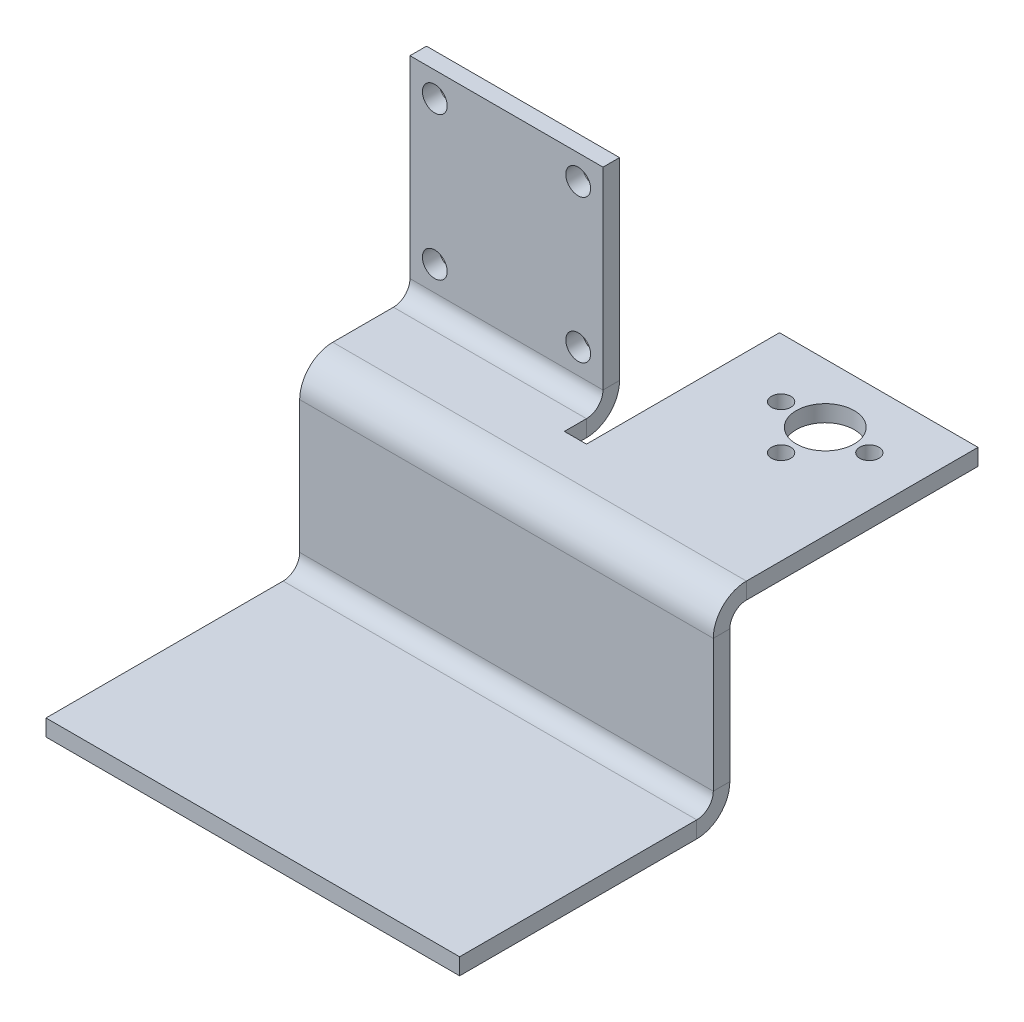
ISO-10303-21;
HEADER;
FILE_DESCRIPTION(('STEP AP214'),'2;1');
FILE_NAME('part.step','',(''),(''),'','','');
FILE_SCHEMA(('AUTOMOTIVE_DESIGN { 1 0 10303 214 1 1 1 1 }'));
ENDSEC;
DATA;
#1=APPLICATION_CONTEXT('core data for automotive mechanical design processes');
#2=APPLICATION_PROTOCOL_DEFINITION('international standard','automotive_design',2000,#1);
#3=PRODUCT_CONTEXT('',#1,'mechanical');
#4=PRODUCT('Part','Part','',(#3));
#5=PRODUCT_RELATED_PRODUCT_CATEGORY('part','',(#4));
#6=PRODUCT_DEFINITION_FORMATION('','',#4);
#7=PRODUCT_DEFINITION_CONTEXT('part definition',#1,'design');
#8=PRODUCT_DEFINITION('design','',#6,#7);
#9=PRODUCT_DEFINITION_SHAPE('','',#8);
#10=(LENGTH_UNIT() NAMED_UNIT(*) SI_UNIT(.MILLI.,.METRE.));
#11=(NAMED_UNIT(*) PLANE_ANGLE_UNIT() SI_UNIT($,.RADIAN.));
#12=(NAMED_UNIT(*) SI_UNIT($,.STERADIAN.) SOLID_ANGLE_UNIT());
#13=UNCERTAINTY_MEASURE_WITH_UNIT(LENGTH_MEASURE(1.E-05),#10,'distance_accuracy_value','');
#14=(GEOMETRIC_REPRESENTATION_CONTEXT(3) GLOBAL_UNCERTAINTY_ASSIGNED_CONTEXT((#13)) GLOBAL_UNIT_ASSIGNED_CONTEXT((#10,
#11,#12)) REPRESENTATION_CONTEXT('',''));
#15=CARTESIAN_POINT('',(0.,0.,0.));
#16=DIRECTION('',(0.,0.,1.));
#17=DIRECTION('',(1.,0.,0.));
#18=AXIS2_PLACEMENT_3D('',#15,#16,#17);
#19=CARTESIAN_POINT('',(57.5,-23.5,20.));
#20=DIRECTION('',(-1.,0.,0.));
#21=DIRECTION('',(0.,0.,1.));
#22=AXIS2_PLACEMENT_3D('',#19,#20,#21);
#23=PLANE('',#22);
#24=DIRECTION('',(0.,0.,-1.));
#25=VECTOR('',#24,1.);
#26=CARTESIAN_POINT('',(57.5,-50.5000000000001,20.));
#27=LINE('',#26,#25);
#28=CARTESIAN_POINT('',(57.5,-50.5000000000001,20.));
#29=VERTEX_POINT('',#28);
#30=CARTESIAN_POINT('',(57.5,-50.5000000000001,17.));
#31=VERTEX_POINT('',#30);
#32=EDGE_CURVE('E318',#29,#31,#27,.T.);
#33=ORIENTED_EDGE('',*,*,#32,.T.);
#34=DIRECTION('',(0.,1.,0.));
#35=VECTOR('',#34,1.);
#36=CARTESIAN_POINT('',(57.5,-23.5,17.));
#37=LINE('',#36,#35);
#38=CARTESIAN_POINT('',(57.5,-26.5,17.));
#39=VERTEX_POINT('',#38);
#40=EDGE_CURVE('E344',#31,#39,#37,.T.);
#41=ORIENTED_EDGE('',*,*,#40,.T.);
#42=DIRECTION('',(0.,0.,1.));
#43=VECTOR('',#42,1.);
#44=CARTESIAN_POINT('',(57.5,-26.5,17.));
#45=LINE('',#44,#43);
#46=CARTESIAN_POINT('',(57.5,-26.5,20.));
#47=VERTEX_POINT('',#46);
#48=EDGE_CURVE('E330',#39,#47,#45,.T.);
#49=ORIENTED_EDGE('',*,*,#48,.T.);
#50=DIRECTION('',(0.,1.,0.));
#51=VECTOR('',#50,1.);
#52=CARTESIAN_POINT('',(57.5,-23.5,20.));
#53=LINE('',#52,#51);
#54=EDGE_CURVE('E345',#29,#47,#53,.T.);
#55=ORIENTED_EDGE('',*,*,#54,.F.);
#56=EDGE_LOOP('',(#33,#41,#49,#55));
#57=FACE_BOUND('',#56,.T.);
#58=ADVANCED_FACE('F69',(#57),#23,.F.);
#59=CARTESIAN_POINT('',(-17.5,-53.5,20.));
#60=DIRECTION('',(1.,0.,0.));
#61=DIRECTION('',(0.,1.,0.));
#62=AXIS2_PLACEMENT_3D('',#59,#60,#61);
#63=PLANE('',#62);
#64=DIRECTION('',(0.,0.,-1.));
#65=VECTOR('',#64,1.);
#66=CARTESIAN_POINT('',(-17.5,-50.5000000000001,20.));
#67=LINE('',#66,#65);
#68=CARTESIAN_POINT('',(-17.5,-50.5000000000001,20.));
#69=VERTEX_POINT('',#68);
#70=CARTESIAN_POINT('',(-17.5,-50.5,17.));
#71=VERTEX_POINT('',#70);
#72=EDGE_CURVE('E328',#69,#71,#67,.T.);
#73=ORIENTED_EDGE('',*,*,#72,.F.);
#74=DIRECTION('',(0.,-1.,0.));
#75=VECTOR('',#74,1.);
#76=CARTESIAN_POINT('',(-17.5,-53.5,20.));
#77=LINE('',#76,#75);
#78=CARTESIAN_POINT('',(-17.5,-26.5,20.));
#79=VERTEX_POINT('',#78);
#80=EDGE_CURVE('E348',#79,#69,#77,.T.);
#81=ORIENTED_EDGE('',*,*,#80,.F.);
#82=DIRECTION('',(0.,0.,1.));
#83=VECTOR('',#82,1.);
#84=CARTESIAN_POINT('',(-17.5,-26.5,17.));
#85=LINE('',#84,#83);
#86=CARTESIAN_POINT('',(-17.5,-26.5,17.));
#87=VERTEX_POINT('',#86);
#88=EDGE_CURVE('E335',#87,#79,#85,.T.);
#89=ORIENTED_EDGE('',*,*,#88,.F.);
#90=DIRECTION('',(0.,-1.,0.));
#91=VECTOR('',#90,1.);
#92=CARTESIAN_POINT('',(-17.5,-53.5,17.));
#93=LINE('',#92,#91);
#94=EDGE_CURVE('E349',#87,#71,#93,.T.);
#95=ORIENTED_EDGE('',*,*,#94,.T.);
#96=EDGE_LOOP('',(#73,#81,#89,#95));
#97=FACE_BOUND('',#96,.T.);
#98=ADVANCED_FACE('F587',(#97),#63,.F.);
#99=CARTESIAN_POINT('',(0.,0.,20.));
#100=DIRECTION('',(0.,0.,-1.));
#101=DIRECTION('',(-1.,0.,0.));
#102=AXIS2_PLACEMENT_3D('',#99,#100,#101);
#103=PLANE('',#102);
#104=DIRECTION('',(1.,0.,0.));
#105=VECTOR('',#104,1.);
#106=CARTESIAN_POINT('',(57.5,-50.5000000000001,20.));
#107=LINE('',#106,#105);
#108=EDGE_CURVE('E323',#29,#69,#107,.F.);
#109=ORIENTED_EDGE('',*,*,#108,.F.);
#110=ORIENTED_EDGE('',*,*,#54,.T.);
#111=DIRECTION('',(1.,0.,0.));
#112=VECTOR('',#111,1.);
#113=CARTESIAN_POINT('',(0.,-26.5,20.));
#114=LINE('',#113,#112);
#115=EDGE_CURVE('E338',#79,#47,#114,.T.);
#116=ORIENTED_EDGE('',*,*,#115,.F.);
#117=ORIENTED_EDGE('',*,*,#80,.T.);
#118=EDGE_LOOP('',(#109,#110,#116,#117));
#119=FACE_BOUND('',#118,.T.);
#120=ADVANCED_FACE('F592',(#119),#103,.F.);
#121=CARTESIAN_POINT('',(0.,0.,17.));
#122=DIRECTION('',(0.,0.,-1.));
#123=DIRECTION('',(-1.,0.,0.));
#124=AXIS2_PLACEMENT_3D('',#121,#122,#123);
#125=PLANE('',#124);
#126=ORIENTED_EDGE('',*,*,#40,.F.);
#127=DIRECTION('',(1.,0.,0.));
#128=VECTOR('',#127,1.);
#129=CARTESIAN_POINT('',(57.5,-50.5000000000001,17.));
#130=LINE('',#129,#128);
#131=EDGE_CURVE('E261',#31,#71,#130,.F.);
#132=ORIENTED_EDGE('',*,*,#131,.T.);
#133=ORIENTED_EDGE('',*,*,#94,.F.);
#134=DIRECTION('',(-1.,0.,0.));
#135=VECTOR('',#134,1.);
#136=CARTESIAN_POINT('',(57.5,-26.5,17.));
#137=LINE('',#136,#135);
#138=EDGE_CURVE('E332',#39,#87,#137,.T.);
#139=ORIENTED_EDGE('',*,*,#138,.F.);
#140=EDGE_LOOP('',(#126,#132,#133,#139));
#141=FACE_BOUND('',#140,.T.);
#142=ADVANCED_FACE('F584',(#141),#125,.T.);
#143=CARTESIAN_POINT('',(-17.5,-23.5,0.));
#144=DIRECTION('',(1.,0.,0.));
#145=DIRECTION('',(0.,0.,-1.));
#146=AXIS2_PLACEMENT_3D('',#143,#144,#145);
#147=PLANE('',#146);
#148=DIRECTION('',(0.,1.,0.));
#149=VECTOR('',#148,1.);
#150=CARTESIAN_POINT('',(-17.5,-23.5,14.));
#151=LINE('',#150,#149);
#152=CARTESIAN_POINT('',(-17.5,-23.5,14.));
#153=VERTEX_POINT('',#152);
#154=CARTESIAN_POINT('',(-17.5,-20.5,14.));
#155=VERTEX_POINT('',#154);
#156=EDGE_CURVE('E368',#153,#155,#151,.T.);
#157=ORIENTED_EDGE('',*,*,#156,.T.);
#158=DIRECTION('',(0.,0.,1.));
#159=VECTOR('',#158,1.);
#160=CARTESIAN_POINT('',(-17.5,-20.5,0.));
#161=LINE('',#160,#159);
#162=CARTESIAN_POINT('',(-17.5,-20.5,2.99999999999999));
#163=VERTEX_POINT('',#162);
#164=EDGE_CURVE('E439',#155,#163,#161,.F.);
#165=ORIENTED_EDGE('',*,*,#164,.T.);
#166=DIRECTION('',(0.,1.,0.));
#167=VECTOR('',#166,1.);
#168=CARTESIAN_POINT('',(-17.5,-23.5,2.99999999999998));
#169=LINE('',#168,#167);
#170=CARTESIAN_POINT('',(-17.5,-23.5,2.99999999999998));
#171=VERTEX_POINT('',#170);
#172=EDGE_CURVE('E420',#163,#171,#169,.F.);
#173=ORIENTED_EDGE('',*,*,#172,.T.);
#174=DIRECTION('',(0.,0.,-1.));
#175=VECTOR('',#174,1.);
#176=CARTESIAN_POINT('',(-17.5,-23.5,0.));
#177=LINE('',#176,#175);
#178=EDGE_CURVE('E432',#153,#171,#177,.T.);
#179=ORIENTED_EDGE('',*,*,#178,.F.);
#180=EDGE_LOOP('',(#157,#165,#173,#179));
#181=FACE_BOUND('',#180,.T.);
#182=ADVANCED_FACE('F562',(#181),#147,.F.);
#183=CARTESIAN_POINT('',(0.,-23.5,0.));
#184=DIRECTION('',(0.,1.,0.));
#185=DIRECTION('',(0.,0.,1.));
#186=AXIS2_PLACEMENT_3D('',#183,#184,#185);
#187=PLANE('',#186);
#188=CARTESIAN_POINT('',(32.5,-23.4999999999999,-17.3));
#189=DIRECTION('',(0.,1.,0.));
#190=DIRECTION('',(0.,0.,1.));
#191=AXIS2_PLACEMENT_3D('',#188,#189,#190);
#192=CIRCLE('',#191,1.75);
#193=CARTESIAN_POINT('',(32.5,-23.4999999999999,-15.55));
#194=VERTEX_POINT('',#193);
#195=EDGE_CURVE('E1033',#194,#194,#192,.T.);
#196=ORIENTED_EDGE('',*,*,#195,.T.);
#197=EDGE_LOOP('',(#196));
#198=FACE_BOUND('',#197,.T.);
#199=CARTESIAN_POINT('',(48.5,-23.4999999999999,-17.3));
#200=DIRECTION('',(0.,1.,0.));
#201=DIRECTION('',(0.,0.,1.));
#202=AXIS2_PLACEMENT_3D('',#199,#200,#201);
#203=CIRCLE('',#202,1.75);
#204=CARTESIAN_POINT('',(48.5,-23.4999999999999,-15.55));
#205=VERTEX_POINT('',#204);
#206=EDGE_CURVE('E1036',#205,#205,#203,.T.);
#207=ORIENTED_EDGE('',*,*,#206,.T.);
#208=EDGE_LOOP('',(#207));
#209=FACE_BOUND('',#208,.T.);
#210=CARTESIAN_POINT('',(40.5,-23.5,-9.29999999999999));
#211=DIRECTION('',(0.,1.,0.));
#212=DIRECTION('',(0.,0.,1.));
#213=AXIS2_PLACEMENT_3D('',#210,#211,#212);
#214=CIRCLE('',#213,1.75);
#215=CARTESIAN_POINT('',(40.5,-23.5,-7.54999999999999));
#216=VERTEX_POINT('',#215);
#217=EDGE_CURVE('E1043',#216,#216,#214,.T.);
#218=ORIENTED_EDGE('',*,*,#217,.T.);
#219=EDGE_LOOP('',(#218));
#220=FACE_BOUND('',#219,.T.);
#221=CARTESIAN_POINT('',(40.5,-23.4999999999999,-17.3));
#222=DIRECTION('',(0.,1.,0.));
#223=DIRECTION('',(0.,0.,1.));
#224=AXIS2_PLACEMENT_3D('',#221,#222,#223);
#225=CIRCLE('',#224,5.25);
#226=CARTESIAN_POINT('',(40.5,-23.4999999999999,-12.05));
#227=VERTEX_POINT('',#226);
#228=EDGE_CURVE('E1057',#227,#227,#225,.T.);
#229=ORIENTED_EDGE('',*,*,#228,.T.);
#230=EDGE_LOOP('',(#229));
#231=FACE_BOUND('',#230,.T.);
#232=DIRECTION('',(-1.,0.,0.));
#233=VECTOR('',#232,1.);
#234=CARTESIAN_POINT('',(-17.5,-23.5,14.));
#235=LINE('',#234,#233);
#236=CARTESIAN_POINT('',(57.5,-23.5,14.));
#237=VERTEX_POINT('',#236);
#238=EDGE_CURVE('E376',#153,#237,#235,.F.);
#239=ORIENTED_EDGE('',*,*,#238,.F.);
#240=ORIENTED_EDGE('',*,*,#178,.T.);
#241=DIRECTION('',(1.,0.,0.));
#242=VECTOR('',#241,1.);
#243=CARTESIAN_POINT('',(-17.5,-23.5,2.99999999999998));
#244=LINE('',#243,#242);
#245=CARTESIAN_POINT('',(17.5,-23.5,2.99999999999998));
#246=VERTEX_POINT('',#245);
#247=EDGE_CURVE('E442',#246,#171,#244,.F.);
#248=ORIENTED_EDGE('',*,*,#247,.F.);
#249=DIRECTION('',(0.,0.,1.));
#250=VECTOR('',#249,1.);
#251=CARTESIAN_POINT('',(17.5,-23.5,0.));
#252=LINE('',#251,#250);
#253=CARTESIAN_POINT('',(17.5,-23.5,6.99999999999998));
#254=VERTEX_POINT('',#253);
#255=EDGE_CURVE('E427',#246,#254,#252,.T.);
#256=ORIENTED_EDGE('',*,*,#255,.T.);
#257=DIRECTION('',(1.,0.,0.));
#258=VECTOR('',#257,1.);
#259=CARTESIAN_POINT('',(0.,-23.5,6.99999999999998));
#260=LINE('',#259,#258);
#261=CARTESIAN_POINT('',(21.5,-23.5,6.99999999999998));
#262=VERTEX_POINT('',#261);
#263=EDGE_CURVE('E406',#254,#262,#260,.T.);
#264=ORIENTED_EDGE('',*,*,#263,.T.);
#265=DIRECTION('',(0.,0.,-1.));
#266=VECTOR('',#265,1.);
#267=CARTESIAN_POINT('',(21.5,-23.5,0.));
#268=LINE('',#267,#266);
#269=CARTESIAN_POINT('',(21.5,-23.4999999999999,-28.));
#270=VERTEX_POINT('',#269);
#271=EDGE_CURVE('E410',#262,#270,#268,.T.);
#272=ORIENTED_EDGE('',*,*,#271,.T.);
#273=DIRECTION('',(-1.,0.,0.));
#274=VECTOR('',#273,1.);
#275=CARTESIAN_POINT('',(0.,-23.4999999999999,-28.));
#276=LINE('',#275,#274);
#277=CARTESIAN_POINT('',(57.5,-23.4999999999999,-28.));
#278=VERTEX_POINT('',#277);
#279=EDGE_CURVE('E392',#278,#270,#276,.T.);
#280=ORIENTED_EDGE('',*,*,#279,.F.);
#281=DIRECTION('',(0.,0.,-1.));
#282=VECTOR('',#281,1.);
#283=CARTESIAN_POINT('',(57.5,-23.5,0.));
#284=LINE('',#283,#282);
#285=EDGE_CURVE('E385',#237,#278,#284,.T.);
#286=ORIENTED_EDGE('',*,*,#285,.F.);
#287=EDGE_LOOP('',(#239,#240,#248,#256,#264,#272,#280,#286));
#288=FACE_BOUND('',#287,.T.);
#289=ADVANCED_FACE('F552',(#198,#209,#220,#231,#288),#187,.F.);
#290=CARTESIAN_POINT('',(0.,-20.5,0.));
#291=DIRECTION('',(0.,1.,0.));
#292=DIRECTION('',(0.,0.,1.));
#293=AXIS2_PLACEMENT_3D('',#290,#291,#292);
#294=PLANE('',#293);
#295=CARTESIAN_POINT('',(32.5,-20.4999999999999,-17.3));
#296=DIRECTION('',(0.,1.,0.));
#297=DIRECTION('',(0.,0.,1.));
#298=AXIS2_PLACEMENT_3D('',#295,#296,#297);
#299=CIRCLE('',#298,1.75);
#300=CARTESIAN_POINT('',(32.5,-20.4999999999999,-15.55));
#301=VERTEX_POINT('',#300);
#302=EDGE_CURVE('E1030',#301,#301,#299,.T.);
#303=ORIENTED_EDGE('',*,*,#302,.F.);
#304=EDGE_LOOP('',(#303));
#305=FACE_BOUND('',#304,.T.);
#306=CARTESIAN_POINT('',(48.5,-20.4999999999999,-17.3));
#307=DIRECTION('',(0.,1.,0.));
#308=DIRECTION('',(0.,0.,1.));
#309=AXIS2_PLACEMENT_3D('',#306,#307,#308);
#310=CIRCLE('',#309,1.75);
#311=CARTESIAN_POINT('',(48.5,-20.4999999999999,-15.55));
#312=VERTEX_POINT('',#311);
#313=EDGE_CURVE('E1063',#312,#312,#310,.T.);
#314=ORIENTED_EDGE('',*,*,#313,.F.);
#315=EDGE_LOOP('',(#314));
#316=FACE_BOUND('',#315,.T.);
#317=CARTESIAN_POINT('',(40.5,-20.5,-9.29999999999998));
#318=DIRECTION('',(0.,1.,0.));
#319=DIRECTION('',(0.,0.,1.));
#320=AXIS2_PLACEMENT_3D('',#317,#318,#319);
#321=CIRCLE('',#320,1.75);
#322=CARTESIAN_POINT('',(40.5,-20.5,-7.54999999999998));
#323=VERTEX_POINT('',#322);
#324=EDGE_CURVE('E1058',#323,#323,#321,.T.);
#325=ORIENTED_EDGE('',*,*,#324,.F.);
#326=EDGE_LOOP('',(#325));
#327=FACE_BOUND('',#326,.T.);
#328=CARTESIAN_POINT('',(40.5,-20.4999999999999,-17.3));
#329=DIRECTION('',(0.,1.,0.));
#330=DIRECTION('',(0.,0.,1.));
#331=AXIS2_PLACEMENT_3D('',#328,#329,#330);
#332=CIRCLE('',#331,5.25);
#333=CARTESIAN_POINT('',(40.5,-20.4999999999999,-12.05));
#334=VERTEX_POINT('',#333);
#335=EDGE_CURVE('E1054',#334,#334,#332,.T.);
#336=ORIENTED_EDGE('',*,*,#335,.F.);
#337=EDGE_LOOP('',(#336));
#338=FACE_BOUND('',#337,.T.);
#339=ORIENTED_EDGE('',*,*,#164,.F.);
#340=DIRECTION('',(-1.,0.,0.));
#341=VECTOR('',#340,1.);
#342=CARTESIAN_POINT('',(-17.5,-20.5,14.));
#343=LINE('',#342,#341);
#344=CARTESIAN_POINT('',(57.5,-20.5,14.));
#345=VERTEX_POINT('',#344);
#346=EDGE_CURVE('E359',#155,#345,#343,.F.);
#347=ORIENTED_EDGE('',*,*,#346,.T.);
#348=DIRECTION('',(0.,0.,-1.));
#349=VECTOR('',#348,1.);
#350=CARTESIAN_POINT('',(57.5,-20.5,0.));
#351=LINE('',#350,#349);
#352=CARTESIAN_POINT('',(57.5,-20.4999999999999,-28.));
#353=VERTEX_POINT('',#352);
#354=EDGE_CURVE('E388',#345,#353,#351,.T.);
#355=ORIENTED_EDGE('',*,*,#354,.T.);
#356=DIRECTION('',(-1.,0.,0.));
#357=VECTOR('',#356,1.);
#358=CARTESIAN_POINT('',(0.,-20.4999999999999,-28.));
#359=LINE('',#358,#357);
#360=CARTESIAN_POINT('',(21.5,-20.4999999999999,-28.));
#361=VERTEX_POINT('',#360);
#362=EDGE_CURVE('E400',#353,#361,#359,.T.);
#363=ORIENTED_EDGE('',*,*,#362,.T.);
#364=DIRECTION('',(0.,0.,-1.));
#365=VECTOR('',#364,1.);
#366=CARTESIAN_POINT('',(21.5,-20.5,0.));
#367=LINE('',#366,#365);
#368=CARTESIAN_POINT('',(21.5,-20.5,6.99999999999999));
#369=VERTEX_POINT('',#368);
#370=EDGE_CURVE('E396',#369,#361,#367,.T.);
#371=ORIENTED_EDGE('',*,*,#370,.F.);
#372=DIRECTION('',(1.,0.,0.));
#373=VECTOR('',#372,1.);
#374=CARTESIAN_POINT('',(0.,-20.5,6.99999999999999));
#375=LINE('',#374,#373);
#376=CARTESIAN_POINT('',(17.5,-20.5,6.99999999999999));
#377=VERTEX_POINT('',#376);
#378=EDGE_CURVE('E391',#377,#369,#375,.T.);
#379=ORIENTED_EDGE('',*,*,#378,.F.);
#380=DIRECTION('',(0.,0.,-1.));
#381=VECTOR('',#380,1.);
#382=CARTESIAN_POINT('',(17.5,-20.5,17.));
#383=LINE('',#382,#381);
#384=CARTESIAN_POINT('',(17.5,-20.5,2.99999999999999));
#385=VERTEX_POINT('',#384);
#386=EDGE_CURVE('E435',#385,#377,#383,.F.);
#387=ORIENTED_EDGE('',*,*,#386,.F.);
#388=DIRECTION('',(1.,0.,0.));
#389=VECTOR('',#388,1.);
#390=CARTESIAN_POINT('',(-17.5,-20.5,2.99999999999999));
#391=LINE('',#390,#389);
#392=EDGE_CURVE('E449',#163,#385,#391,.T.);
#393=ORIENTED_EDGE('',*,*,#392,.F.);
#394=EDGE_LOOP('',(#339,#347,#355,#363,#371,#379,#387,#393));
#395=FACE_BOUND('',#394,.T.);
#396=ADVANCED_FACE('F543',(#305,#316,#327,#338,#395),#294,.T.);
#397=CARTESIAN_POINT('',(57.5,-20.5,0.));
#398=DIRECTION('',(-1.,0.,0.));
#399=DIRECTION('',(0.,0.,1.));
#400=AXIS2_PLACEMENT_3D('',#397,#398,#399);
#401=PLANE('',#400);
#402=DIRECTION('',(0.,1.,0.));
#403=VECTOR('',#402,1.);
#404=CARTESIAN_POINT('',(57.5,-23.5,14.));
#405=LINE('',#404,#403);
#406=EDGE_CURVE('E382',#237,#345,#405,.T.);
#407=ORIENTED_EDGE('',*,*,#406,.F.);
#408=ORIENTED_EDGE('',*,*,#285,.T.);
#409=DIRECTION('',(0.,-1.,0.));
#410=VECTOR('',#409,1.);
#411=CARTESIAN_POINT('',(57.5,-20.4999999999999,-28.));
#412=LINE('',#411,#410);
#413=EDGE_CURVE('E417',#353,#278,#412,.T.);
#414=ORIENTED_EDGE('',*,*,#413,.F.);
#415=ORIENTED_EDGE('',*,*,#354,.F.);
#416=EDGE_LOOP('',(#407,#408,#414,#415));
#417=FACE_BOUND('',#416,.T.);
#418=ADVANCED_FACE('F576',(#417),#401,.F.);
#419=CARTESIAN_POINT('',(17.5,-17.5,-3.));
#420=DIRECTION('',(1.,0.,0.));
#421=DIRECTION('',(0.,1.,0.));
#422=AXIS2_PLACEMENT_3D('',#419,#420,#421);
#423=PLANE('',#422);
#424=DIRECTION('',(0.,1.,0.));
#425=VECTOR('',#424,1.);
#426=CARTESIAN_POINT('',(17.5,-17.5,0.));
#427=LINE('',#426,#425);
#428=CARTESIAN_POINT('',(17.5,-17.5,0.));
#429=VERTEX_POINT('',#428);
#430=CARTESIAN_POINT('',(17.5,17.5,0.));
#431=VERTEX_POINT('',#430);
#432=EDGE_CURVE('E124',#429,#431,#427,.T.);
#433=ORIENTED_EDGE('',*,*,#432,.F.);
#434=DIRECTION('',(0.,0.,1.));
#435=VECTOR('',#434,1.);
#436=CARTESIAN_POINT('',(17.5,-17.5,-3.));
#437=LINE('',#436,#435);
#438=CARTESIAN_POINT('',(17.5,-17.5,-3.));
#439=VERTEX_POINT('',#438);
#440=EDGE_CURVE('E13',#439,#429,#437,.T.);
#441=ORIENTED_EDGE('',*,*,#440,.F.);
#442=DIRECTION('',(0.,1.,0.));
#443=VECTOR('',#442,1.);
#444=CARTESIAN_POINT('',(17.5,-17.5,-3.));
#445=LINE('',#444,#443);
#446=CARTESIAN_POINT('',(17.5,17.5,-3.));
#447=VERTEX_POINT('',#446);
#448=EDGE_CURVE('E500',#439,#447,#445,.T.);
#449=ORIENTED_EDGE('',*,*,#448,.T.);
#450=DIRECTION('',(0.,0.,1.));
#451=VECTOR('',#450,1.);
#452=CARTESIAN_POINT('',(17.5,17.5,-3.));
#453=LINE('',#452,#451);
#454=EDGE_CURVE('E73',#447,#431,#453,.T.);
#455=ORIENTED_EDGE('',*,*,#454,.T.);
#456=EDGE_LOOP('',(#433,#441,#449,#455));
#457=FACE_BOUND('',#456,.T.);
#458=ADVANCED_FACE('F71',(#457),#423,.T.);
#459=CARTESIAN_POINT('',(-17.5,-17.5,-3.));
#460=DIRECTION('',(-1.,0.,0.));
#461=DIRECTION('',(0.,0.,1.));
#462=AXIS2_PLACEMENT_3D('',#459,#460,#461);
#463=PLANE('',#462);
#464=DIRECTION('',(0.,-1.,0.));
#465=VECTOR('',#464,1.);
#466=CARTESIAN_POINT('',(-17.5,-17.5,0.));
#467=LINE('',#466,#465);
#468=CARTESIAN_POINT('',(-17.5,17.5,0.));
#469=VERTEX_POINT('',#468);
#470=CARTESIAN_POINT('',(-17.5,-17.5,0.));
#471=VERTEX_POINT('',#470);
#472=EDGE_CURVE('E520',#469,#471,#467,.T.);
#473=ORIENTED_EDGE('',*,*,#472,.F.);
#474=DIRECTION('',(0.,0.,1.));
#475=VECTOR('',#474,1.);
#476=CARTESIAN_POINT('',(-17.5,17.5,-3.));
#477=LINE('',#476,#475);
#478=CARTESIAN_POINT('',(-17.5,17.5,-3.));
#479=VERTEX_POINT('',#478);
#480=EDGE_CURVE('E526',#479,#469,#477,.T.);
#481=ORIENTED_EDGE('',*,*,#480,.F.);
#482=DIRECTION('',(0.,-1.,0.));
#483=VECTOR('',#482,1.);
#484=CARTESIAN_POINT('',(-17.5,-17.5,-3.));
#485=LINE('',#484,#483);
#486=CARTESIAN_POINT('',(-17.5,-17.5,-3.));
#487=VERTEX_POINT('',#486);
#488=EDGE_CURVE('E101',#479,#487,#485,.T.);
#489=ORIENTED_EDGE('',*,*,#488,.T.);
#490=DIRECTION('',(0.,0.,1.));
#491=VECTOR('',#490,1.);
#492=CARTESIAN_POINT('',(-17.5,-17.5,-3.));
#493=LINE('',#492,#491);
#494=EDGE_CURVE('E78',#487,#471,#493,.T.);
#495=ORIENTED_EDGE('',*,*,#494,.T.);
#496=EDGE_LOOP('',(#473,#481,#489,#495));
#497=FACE_BOUND('',#496,.T.);
#498=ADVANCED_FACE('F671',(#497),#463,.T.);
#499=CARTESIAN_POINT('',(-17.5,17.5,-3.));
#500=DIRECTION('',(0.,1.,0.));
#501=DIRECTION('',(-1.,0.,0.));
#502=AXIS2_PLACEMENT_3D('',#499,#500,#501);
#503=PLANE('',#502);
#504=DIRECTION('',(-1.,0.,0.));
#505=VECTOR('',#504,1.);
#506=CARTESIAN_POINT('',(-17.5,17.5,0.));
#507=LINE('',#506,#505);
#508=EDGE_CURVE('E516',#431,#469,#507,.T.);
#509=ORIENTED_EDGE('',*,*,#508,.F.);
#510=ORIENTED_EDGE('',*,*,#454,.F.);
#511=DIRECTION('',(-1.,0.,0.));
#512=VECTOR('',#511,1.);
#513=CARTESIAN_POINT('',(-17.5,17.5,-3.));
#514=LINE('',#513,#512);
#515=EDGE_CURVE('E504',#447,#479,#514,.T.);
#516=ORIENTED_EDGE('',*,*,#515,.T.);
#517=ORIENTED_EDGE('',*,*,#480,.T.);
#518=EDGE_LOOP('',(#509,#510,#516,#517));
#519=FACE_BOUND('',#518,.T.);
#520=ADVANCED_FACE('F528',(#519),#503,.T.);
#521=CARTESIAN_POINT('',(0.,0.,-3.));
#522=DIRECTION('',(0.,0.,-1.));
#523=DIRECTION('',(-1.,0.,0.));
#524=AXIS2_PLACEMENT_3D('',#521,#522,#523);
#525=PLANE('',#524);
#526=CARTESIAN_POINT('',(-13.,-13.,-3.));
#527=DIRECTION('',(0.,0.,1.));
#528=DIRECTION('',(1.,0.,0.));
#529=AXIS2_PLACEMENT_3D('',#526,#527,#528);
#530=CIRCLE('',#529,2.25);
#531=CARTESIAN_POINT('',(-10.75,-13.,-3.));
#532=VERTEX_POINT('',#531);
#533=EDGE_CURVE('E469',#532,#532,#530,.T.);
#534=ORIENTED_EDGE('',*,*,#533,.T.);
#535=EDGE_LOOP('',(#534));
#536=FACE_BOUND('',#535,.T.);
#537=CARTESIAN_POINT('',(13.,-13.,-3.));
#538=DIRECTION('',(0.,0.,1.));
#539=DIRECTION('',(1.,0.,0.));
#540=AXIS2_PLACEMENT_3D('',#537,#538,#539);
#541=CIRCLE('',#540,2.25);
#542=CARTESIAN_POINT('',(15.25,-13.,-3.));
#543=VERTEX_POINT('',#542);
#544=EDGE_CURVE('E477',#543,#543,#541,.T.);
#545=ORIENTED_EDGE('',*,*,#544,.T.);
#546=EDGE_LOOP('',(#545));
#547=FACE_BOUND('',#546,.T.);
#548=CARTESIAN_POINT('',(13.,13.,-3.));
#549=DIRECTION('',(0.,0.,1.));
#550=DIRECTION('',(1.,0.,0.));
#551=AXIS2_PLACEMENT_3D('',#548,#549,#550);
#552=CIRCLE('',#551,2.25);
#553=CARTESIAN_POINT('',(15.25,13.,-3.));
#554=VERTEX_POINT('',#553);
#555=EDGE_CURVE('E485',#554,#554,#552,.T.);
#556=ORIENTED_EDGE('',*,*,#555,.T.);
#557=EDGE_LOOP('',(#556));
#558=FACE_BOUND('',#557,.T.);
#559=CARTESIAN_POINT('',(-13.,13.,-3.));
#560=DIRECTION('',(0.,0.,1.));
#561=DIRECTION('',(1.,0.,0.));
#562=AXIS2_PLACEMENT_3D('',#559,#560,#561);
#563=CIRCLE('',#562,2.25);
#564=CARTESIAN_POINT('',(-10.75,13.,-3.));
#565=VERTEX_POINT('',#564);
#566=EDGE_CURVE('E493',#565,#565,#563,.T.);
#567=ORIENTED_EDGE('',*,*,#566,.T.);
#568=EDGE_LOOP('',(#567));
#569=FACE_BOUND('',#568,.T.);
#570=ORIENTED_EDGE('',*,*,#448,.F.);
#571=DIRECTION('',(1.,0.,0.));
#572=VECTOR('',#571,1.);
#573=CARTESIAN_POINT('',(-17.5,-17.5,-3.));
#574=LINE('',#573,#572);
#575=EDGE_CURVE('E510',#487,#439,#574,.T.);
#576=ORIENTED_EDGE('',*,*,#575,.F.);
#577=ORIENTED_EDGE('',*,*,#488,.F.);
#578=ORIENTED_EDGE('',*,*,#515,.F.);
#579=EDGE_LOOP('',(#570,#576,#577,#578));
#580=FACE_BOUND('',#579,.T.);
#581=ADVANCED_FACE('F665',(#536,#547,#558,#569,#580),#525,.T.);
#582=CARTESIAN_POINT('',(0.,0.,0.));
#583=DIRECTION('',(0.,0.,-1.));
#584=DIRECTION('',(-1.,0.,0.));
#585=AXIS2_PLACEMENT_3D('',#582,#583,#584);
#586=PLANE('',#585);
#587=CARTESIAN_POINT('',(-13.,-13.,0.));
#588=DIRECTION('',(0.,0.,1.));
#589=DIRECTION('',(1.,0.,0.));
#590=AXIS2_PLACEMENT_3D('',#587,#588,#589);
#591=CIRCLE('',#590,2.25);
#592=CARTESIAN_POINT('',(-10.75,-13.,0.));
#593=VERTEX_POINT('',#592);
#594=EDGE_CURVE('E458',#593,#593,#591,.T.);
#595=ORIENTED_EDGE('',*,*,#594,.F.);
#596=EDGE_LOOP('',(#595));
#597=FACE_BOUND('',#596,.T.);
#598=CARTESIAN_POINT('',(13.,-13.,0.));
#599=DIRECTION('',(0.,0.,1.));
#600=DIRECTION('',(1.,0.,0.));
#601=AXIS2_PLACEMENT_3D('',#598,#599,#600);
#602=CIRCLE('',#601,2.25);
#603=CARTESIAN_POINT('',(15.25,-13.,0.));
#604=VERTEX_POINT('',#603);
#605=EDGE_CURVE('E473',#604,#604,#602,.T.);
#606=ORIENTED_EDGE('',*,*,#605,.F.);
#607=EDGE_LOOP('',(#606));
#608=FACE_BOUND('',#607,.T.);
#609=CARTESIAN_POINT('',(13.,13.,0.));
#610=DIRECTION('',(0.,0.,1.));
#611=DIRECTION('',(1.,0.,0.));
#612=AXIS2_PLACEMENT_3D('',#609,#610,#611);
#613=CIRCLE('',#612,2.25);
#614=CARTESIAN_POINT('',(15.25,13.,0.));
#615=VERTEX_POINT('',#614);
#616=EDGE_CURVE('E481',#615,#615,#613,.T.);
#617=ORIENTED_EDGE('',*,*,#616,.F.);
#618=EDGE_LOOP('',(#617));
#619=FACE_BOUND('',#618,.T.);
#620=CARTESIAN_POINT('',(-13.,13.,0.));
#621=DIRECTION('',(0.,0.,1.));
#622=DIRECTION('',(1.,0.,0.));
#623=AXIS2_PLACEMENT_3D('',#620,#621,#622);
#624=CIRCLE('',#623,2.25);
#625=CARTESIAN_POINT('',(-10.75,13.,0.));
#626=VERTEX_POINT('',#625);
#627=EDGE_CURVE('E489',#626,#626,#624,.T.);
#628=ORIENTED_EDGE('',*,*,#627,.F.);
#629=EDGE_LOOP('',(#628));
#630=FACE_BOUND('',#629,.T.);
#631=ORIENTED_EDGE('',*,*,#432,.T.);
#632=ORIENTED_EDGE('',*,*,#508,.T.);
#633=ORIENTED_EDGE('',*,*,#472,.T.);
#634=DIRECTION('',(1.,0.,0.));
#635=VECTOR('',#634,1.);
#636=CARTESIAN_POINT('',(-17.5,-17.5,0.));
#637=LINE('',#636,#635);
#638=EDGE_CURVE('E505',#471,#429,#637,.T.);
#639=ORIENTED_EDGE('',*,*,#638,.T.);
#640=EDGE_LOOP('',(#631,#632,#633,#639));
#641=FACE_BOUND('',#640,.T.);
#642=ADVANCED_FACE('F530',(#597,#608,#619,#630,#641),#586,.F.);
#643=CARTESIAN_POINT('',(-13.,13.,-3.));
#644=DIRECTION('',(0.,0.,1.));
#645=DIRECTION('',(1.,0.,0.));
#646=AXIS2_PLACEMENT_3D('',#643,#644,#645);
#647=CYLINDRICAL_SURFACE('',#646,2.25);
#648=ORIENTED_EDGE('',*,*,#566,.F.);
#649=EDGE_LOOP('',(#648));
#650=FACE_BOUND('',#649,.T.);
#651=ORIENTED_EDGE('',*,*,#627,.T.);
#652=EDGE_LOOP('',(#651));
#653=FACE_BOUND('',#652,.T.);
#654=ADVANCED_FACE('F660',(#650,#653),#647,.F.);
#655=CARTESIAN_POINT('',(13.,13.,-3.));
#656=DIRECTION('',(0.,0.,1.));
#657=DIRECTION('',(1.,0.,0.));
#658=AXIS2_PLACEMENT_3D('',#655,#656,#657);
#659=CYLINDRICAL_SURFACE('',#658,2.25);
#660=ORIENTED_EDGE('',*,*,#555,.F.);
#661=EDGE_LOOP('',(#660));
#662=FACE_BOUND('',#661,.T.);
#663=ORIENTED_EDGE('',*,*,#616,.T.);
#664=EDGE_LOOP('',(#663));
#665=FACE_BOUND('',#664,.T.);
#666=ADVANCED_FACE('F656',(#662,#665),#659,.F.);
#667=CARTESIAN_POINT('',(13.,-13.,-3.));
#668=DIRECTION('',(0.,0.,1.));
#669=DIRECTION('',(1.,0.,0.));
#670=AXIS2_PLACEMENT_3D('',#667,#668,#669);
#671=CYLINDRICAL_SURFACE('',#670,2.25);
#672=ORIENTED_EDGE('',*,*,#544,.F.);
#673=EDGE_LOOP('',(#672));
#674=FACE_BOUND('',#673,.T.);
#675=ORIENTED_EDGE('',*,*,#605,.T.);
#676=EDGE_LOOP('',(#675));
#677=FACE_BOUND('',#676,.T.);
#678=ADVANCED_FACE('F652',(#674,#677),#671,.F.);
#679=CARTESIAN_POINT('',(-13.,-13.,-3.));
#680=DIRECTION('',(0.,0.,1.));
#681=DIRECTION('',(1.,0.,0.));
#682=AXIS2_PLACEMENT_3D('',#679,#680,#681);
#683=CYLINDRICAL_SURFACE('',#682,2.25);
#684=ORIENTED_EDGE('',*,*,#533,.F.);
#685=EDGE_LOOP('',(#684));
#686=FACE_BOUND('',#685,.T.);
#687=ORIENTED_EDGE('',*,*,#594,.T.);
#688=EDGE_LOOP('',(#687));
#689=FACE_BOUND('',#688,.T.);
#690=ADVANCED_FACE('F647',(#686,#689),#683,.F.);
#691=CARTESIAN_POINT('',(-17.5,-17.5,3.));
#692=DIRECTION('',(-1.,0.,0.));
#693=DIRECTION('',(0.,0.,1.));
#694=AXIS2_PLACEMENT_3D('',#691,#692,#693);
#695=PLANE('',#694);
#696=ORIENTED_EDGE('',*,*,#172,.F.);
#697=CARTESIAN_POINT('',(-17.5,-17.5,3.));
#698=DIRECTION('',(1.,0.,0.));
#699=DIRECTION('',(0.,0.,-1.));
#700=AXIS2_PLACEMENT_3D('',#697,#698,#699);
#701=CIRCLE('',#700,3.);
#702=EDGE_CURVE('E463',#471,#163,#701,.F.);
#703=ORIENTED_EDGE('',*,*,#702,.F.);
#704=ORIENTED_EDGE('',*,*,#494,.F.);
#705=CARTESIAN_POINT('',(-17.5,-17.5,3.));
#706=DIRECTION('',(1.,0.,0.));
#707=DIRECTION('',(0.,0.,-1.));
#708=AXIS2_PLACEMENT_3D('',#705,#706,#707);
#709=CIRCLE('',#708,6.);
#710=EDGE_CURVE('E454',#487,#171,#709,.F.);
#711=ORIENTED_EDGE('',*,*,#710,.T.);
#712=EDGE_LOOP('',(#696,#703,#704,#711));
#713=FACE_BOUND('',#712,.T.);
#714=ADVANCED_FACE('F560',(#713),#695,.T.);
#715=CARTESIAN_POINT('',(17.5,-17.5,3.));
#716=DIRECTION('',(-1.,0.,0.));
#717=DIRECTION('',(0.,0.,1.));
#718=AXIS2_PLACEMENT_3D('',#715,#716,#717);
#719=PLANE('',#718);
#720=CARTESIAN_POINT('',(17.5,-17.5,3.));
#721=DIRECTION('',(1.,0.,0.));
#722=DIRECTION('',(0.,0.,-1.));
#723=AXIS2_PLACEMENT_3D('',#720,#721,#722);
#724=CIRCLE('',#723,3.);
#725=EDGE_CURVE('E431',#385,#429,#724,.T.);
#726=ORIENTED_EDGE('',*,*,#725,.F.);
#727=DIRECTION('',(0.,1.,0.));
#728=VECTOR('',#727,1.);
#729=CARTESIAN_POINT('',(17.5,-20.5,2.99999999999999));
#730=LINE('',#729,#728);
#731=EDGE_CURVE('E446',#385,#246,#730,.F.);
#732=ORIENTED_EDGE('',*,*,#731,.T.);
#733=CARTESIAN_POINT('',(17.5,-17.5,3.));
#734=DIRECTION('',(1.,0.,0.));
#735=DIRECTION('',(0.,0.,-1.));
#736=AXIS2_PLACEMENT_3D('',#733,#734,#735);
#737=CIRCLE('',#736,6.);
#738=EDGE_CURVE('E459',#246,#439,#737,.T.);
#739=ORIENTED_EDGE('',*,*,#738,.T.);
#740=ORIENTED_EDGE('',*,*,#440,.T.);
#741=EDGE_LOOP('',(#726,#732,#739,#740));
#742=FACE_BOUND('',#741,.T.);
#743=ADVANCED_FACE('F536',(#742),#719,.F.);
#744=CARTESIAN_POINT('',(17.5,-17.5,3.));
#745=DIRECTION('',(1.,0.,0.));
#746=DIRECTION('',(0.,-1.,0.));
#747=AXIS2_PLACEMENT_3D('',#744,#745,#746);
#748=CYLINDRICAL_SURFACE('',#747,6.);
#749=ORIENTED_EDGE('',*,*,#575,.T.);
#750=ORIENTED_EDGE('',*,*,#738,.F.);
#751=ORIENTED_EDGE('',*,*,#247,.T.);
#752=ORIENTED_EDGE('',*,*,#710,.F.);
#753=EDGE_LOOP('',(#749,#750,#751,#752));
#754=FACE_BOUND('',#753,.T.);
#755=ADVANCED_FACE('F556',(#754),#748,.T.);
#756=CARTESIAN_POINT('',(17.5,-17.5,3.));
#757=DIRECTION('',(1.,0.,0.));
#758=DIRECTION('',(0.,-1.,0.));
#759=AXIS2_PLACEMENT_3D('',#756,#757,#758);
#760=CYLINDRICAL_SURFACE('',#759,3.);
#761=ORIENTED_EDGE('',*,*,#638,.F.);
#762=ORIENTED_EDGE('',*,*,#702,.T.);
#763=ORIENTED_EDGE('',*,*,#392,.T.);
#764=ORIENTED_EDGE('',*,*,#725,.T.);
#765=EDGE_LOOP('',(#761,#762,#763,#764));
#766=FACE_BOUND('',#765,.T.);
#767=ADVANCED_FACE('F538',(#766),#760,.F.);
#768=CARTESIAN_POINT('',(17.5,-23.5,17.));
#769=DIRECTION('',(-1.,0.,0.));
#770=DIRECTION('',(0.,0.,1.));
#771=AXIS2_PLACEMENT_3D('',#768,#769,#770);
#772=PLANE('',#771);
#773=ORIENTED_EDGE('',*,*,#386,.T.);
#774=DIRECTION('',(0.,-1.,0.));
#775=VECTOR('',#774,1.);
#776=CARTESIAN_POINT('',(17.5,-20.5,6.99999999999999));
#777=LINE('',#776,#775);
#778=EDGE_CURVE('E403',#377,#254,#777,.T.);
#779=ORIENTED_EDGE('',*,*,#778,.T.);
#780=ORIENTED_EDGE('',*,*,#255,.F.);
#781=ORIENTED_EDGE('',*,*,#731,.F.);
#782=EDGE_LOOP('',(#773,#779,#780,#781));
#783=FACE_BOUND('',#782,.T.);
#784=ADVANCED_FACE('F547',(#783),#772,.F.);
#785=CARTESIAN_POINT('',(0.,-20.4999999999999,-28.));
#786=DIRECTION('',(0.,0.,1.));
#787=DIRECTION('',(0.,-1.,0.));
#788=AXIS2_PLACEMENT_3D('',#785,#786,#787);
#789=PLANE('',#788);
#790=ORIENTED_EDGE('',*,*,#279,.T.);
#791=DIRECTION('',(0.,-1.,0.));
#792=VECTOR('',#791,1.);
#793=CARTESIAN_POINT('',(21.5,-20.4999999999999,-28.));
#794=LINE('',#793,#792);
#795=EDGE_CURVE('E421',#361,#270,#794,.T.);
#796=ORIENTED_EDGE('',*,*,#795,.F.);
#797=ORIENTED_EDGE('',*,*,#362,.F.);
#798=ORIENTED_EDGE('',*,*,#413,.T.);
#799=EDGE_LOOP('',(#790,#796,#797,#798));
#800=FACE_BOUND('',#799,.T.);
#801=ADVANCED_FACE('F599',(#800),#789,.F.);
#802=CARTESIAN_POINT('',(21.5,-20.5,0.));
#803=DIRECTION('',(-1.,0.,0.));
#804=DIRECTION('',(0.,0.,1.));
#805=AXIS2_PLACEMENT_3D('',#802,#803,#804);
#806=PLANE('',#805);
#807=ORIENTED_EDGE('',*,*,#271,.F.);
#808=DIRECTION('',(0.,-1.,0.));
#809=VECTOR('',#808,1.);
#810=CARTESIAN_POINT('',(21.5,-20.5,6.99999999999999));
#811=LINE('',#810,#809);
#812=EDGE_CURVE('E423',#369,#262,#811,.T.);
#813=ORIENTED_EDGE('',*,*,#812,.F.);
#814=ORIENTED_EDGE('',*,*,#370,.T.);
#815=ORIENTED_EDGE('',*,*,#795,.T.);
#816=EDGE_LOOP('',(#807,#813,#814,#815));
#817=FACE_BOUND('',#816,.T.);
#818=ADVANCED_FACE('F602',(#817),#806,.T.);
#819=CARTESIAN_POINT('',(0.,-20.5,6.99999999999999));
#820=DIRECTION('',(0.,0.,-1.));
#821=DIRECTION('',(0.,1.,0.));
#822=AXIS2_PLACEMENT_3D('',#819,#820,#821);
#823=PLANE('',#822);
#824=ORIENTED_EDGE('',*,*,#263,.F.);
#825=ORIENTED_EDGE('',*,*,#778,.F.);
#826=ORIENTED_EDGE('',*,*,#378,.T.);
#827=ORIENTED_EDGE('',*,*,#812,.T.);
#828=EDGE_LOOP('',(#824,#825,#826,#827));
#829=FACE_BOUND('',#828,.T.);
#830=ADVANCED_FACE('F604',(#829),#823,.T.);
#831=CARTESIAN_POINT('',(57.5,-26.5,14.));
#832=DIRECTION('',(1.,0.,0.));
#833=DIRECTION('',(0.,0.,-1.));
#834=AXIS2_PLACEMENT_3D('',#831,#832,#833);
#835=PLANE('',#834);
#836=ORIENTED_EDGE('',*,*,#48,.F.);
#837=CARTESIAN_POINT('',(57.5,-26.5,14.));
#838=DIRECTION('',(-1.,0.,0.));
#839=DIRECTION('',(0.,0.,1.));
#840=AXIS2_PLACEMENT_3D('',#837,#838,#839);
#841=CIRCLE('',#840,3.);
#842=EDGE_CURVE('E372',#237,#39,#841,.F.);
#843=ORIENTED_EDGE('',*,*,#842,.F.);
#844=ORIENTED_EDGE('',*,*,#406,.T.);
#845=CARTESIAN_POINT('',(57.5,-26.5,14.));
#846=DIRECTION('',(-1.,0.,0.));
#847=DIRECTION('',(0.,0.,1.));
#848=AXIS2_PLACEMENT_3D('',#845,#846,#847);
#849=CIRCLE('',#848,6.);
#850=EDGE_CURVE('E363',#345,#47,#849,.F.);
#851=ORIENTED_EDGE('',*,*,#850,.T.);
#852=EDGE_LOOP('',(#836,#843,#844,#851));
#853=FACE_BOUND('',#852,.T.);
#854=ADVANCED_FACE('F580',(#853),#835,.T.);
#855=CARTESIAN_POINT('',(-17.5,-26.5,14.));
#856=DIRECTION('',(1.,0.,0.));
#857=DIRECTION('',(0.,0.,-1.));
#858=AXIS2_PLACEMENT_3D('',#855,#856,#857);
#859=PLANE('',#858);
#860=CARTESIAN_POINT('',(-17.5,-26.5,14.));
#861=DIRECTION('',(-1.,0.,0.));
#862=DIRECTION('',(0.,0.,1.));
#863=AXIS2_PLACEMENT_3D('',#860,#861,#862);
#864=CIRCLE('',#863,3.);
#865=EDGE_CURVE('E353',#87,#153,#864,.T.);
#866=ORIENTED_EDGE('',*,*,#865,.F.);
#867=ORIENTED_EDGE('',*,*,#88,.T.);
#868=CARTESIAN_POINT('',(-17.5,-26.5,14.));
#869=DIRECTION('',(-1.,0.,0.));
#870=DIRECTION('',(0.,0.,1.));
#871=AXIS2_PLACEMENT_3D('',#868,#869,#870);
#872=CIRCLE('',#871,6.);
#873=EDGE_CURVE('E364',#79,#155,#872,.T.);
#874=ORIENTED_EDGE('',*,*,#873,.T.);
#875=ORIENTED_EDGE('',*,*,#156,.F.);
#876=EDGE_LOOP('',(#866,#867,#874,#875));
#877=FACE_BOUND('',#876,.T.);
#878=ADVANCED_FACE('F565',(#877),#859,.F.);
#879=CARTESIAN_POINT('',(-17.5,-26.5,14.));
#880=DIRECTION('',(-1.,0.,0.));
#881=DIRECTION('',(0.,0.,1.));
#882=AXIS2_PLACEMENT_3D('',#879,#880,#881);
#883=CYLINDRICAL_SURFACE('',#882,6.);
#884=ORIENTED_EDGE('',*,*,#346,.F.);
#885=ORIENTED_EDGE('',*,*,#873,.F.);
#886=ORIENTED_EDGE('',*,*,#115,.T.);
#887=ORIENTED_EDGE('',*,*,#850,.F.);
#888=EDGE_LOOP('',(#884,#885,#886,#887));
#889=FACE_BOUND('',#888,.T.);
#890=ADVANCED_FACE('F595',(#889),#883,.T.);
#891=CARTESIAN_POINT('',(-17.5,-26.5,14.));
#892=DIRECTION('',(-1.,0.,0.));
#893=DIRECTION('',(0.,0.,1.));
#894=AXIS2_PLACEMENT_3D('',#891,#892,#893);
#895=CYLINDRICAL_SURFACE('',#894,3.);
#896=ORIENTED_EDGE('',*,*,#238,.T.);
#897=ORIENTED_EDGE('',*,*,#842,.T.);
#898=ORIENTED_EDGE('',*,*,#138,.T.);
#899=ORIENTED_EDGE('',*,*,#865,.T.);
#900=EDGE_LOOP('',(#896,#897,#898,#899));
#901=FACE_BOUND('',#900,.T.);
#902=ADVANCED_FACE('F568',(#901),#895,.F.);
#903=CARTESIAN_POINT('',(-17.5,-50.5000000000001,23.));
#904=DIRECTION('',(-1.,0.,0.));
#905=DIRECTION('',(0.,0.,1.));
#906=AXIS2_PLACEMENT_3D('',#903,#904,#905);
#907=PLANE('',#906);
#908=DIRECTION('',(0.,-1.,0.));
#909=VECTOR('',#908,1.);
#910=CARTESIAN_POINT('',(-17.5,-53.5000000000001,23.));
#911=LINE('',#910,#909);
#912=CARTESIAN_POINT('',(-17.5,-53.5000000000001,23.));
#913=VERTEX_POINT('',#912);
#914=CARTESIAN_POINT('',(-17.5,-56.5000000000001,23.));
#915=VERTEX_POINT('',#914);
#916=EDGE_CURVE('E1035',#913,#915,#911,.T.);
#917=ORIENTED_EDGE('',*,*,#916,.F.);
#918=CARTESIAN_POINT('',(-17.5,-50.5000000000001,23.));
#919=DIRECTION('',(1.,0.,0.));
#920=DIRECTION('',(0.,0.,-1.));
#921=AXIS2_PLACEMENT_3D('',#918,#919,#920);
#922=CIRCLE('',#921,3.);
#923=EDGE_CURVE('E265',#69,#913,#922,.F.);
#924=ORIENTED_EDGE('',*,*,#923,.F.);
#925=ORIENTED_EDGE('',*,*,#72,.T.);
#926=CARTESIAN_POINT('',(-17.5,-50.5000000000001,23.));
#927=DIRECTION('',(1.,0.,0.));
#928=DIRECTION('',(0.,0.,-1.));
#929=AXIS2_PLACEMENT_3D('',#926,#927,#928);
#930=CIRCLE('',#929,6.);
#931=EDGE_CURVE('E89',#71,#915,#930,.F.);
#932=ORIENTED_EDGE('',*,*,#931,.T.);
#933=EDGE_LOOP('',(#917,#924,#925,#932));
#934=FACE_BOUND('',#933,.T.);
#935=ADVANCED_FACE('F626',(#934),#907,.T.);
#936=CARTESIAN_POINT('',(57.5,-50.5000000000001,23.));
#937=DIRECTION('',(-1.,0.,0.));
#938=DIRECTION('',(0.,0.,1.));
#939=AXIS2_PLACEMENT_3D('',#936,#937,#938);
#940=PLANE('',#939);
#941=CARTESIAN_POINT('',(57.5,-50.5000000000001,23.));
#942=DIRECTION('',(1.,0.,0.));
#943=DIRECTION('',(0.,0.,-1.));
#944=AXIS2_PLACEMENT_3D('',#941,#942,#943);
#945=CIRCLE('',#944,3.);
#946=CARTESIAN_POINT('',(57.5,-53.5000000000001,23.));
#947=VERTEX_POINT('',#946);
#948=EDGE_CURVE('E272',#947,#29,#945,.T.);
#949=ORIENTED_EDGE('',*,*,#948,.F.);
#950=DIRECTION('',(0.,-1.,0.));
#951=VECTOR('',#950,1.);
#952=CARTESIAN_POINT('',(57.5,-53.5000000000001,23.));
#953=LINE('',#952,#951);
#954=CARTESIAN_POINT('',(57.5,-56.5000000000001,23.));
#955=VERTEX_POINT('',#954);
#956=EDGE_CURVE('E269',#947,#955,#953,.T.);
#957=ORIENTED_EDGE('',*,*,#956,.T.);
#958=CARTESIAN_POINT('',(57.5,-50.5000000000001,23.));
#959=DIRECTION('',(1.,0.,0.));
#960=DIRECTION('',(0.,0.,-1.));
#961=AXIS2_PLACEMENT_3D('',#958,#959,#960);
#962=CIRCLE('',#961,6.);
#963=EDGE_CURVE('E255',#955,#31,#962,.T.);
#964=ORIENTED_EDGE('',*,*,#963,.T.);
#965=ORIENTED_EDGE('',*,*,#32,.F.);
#966=EDGE_LOOP('',(#949,#957,#964,#965));
#967=FACE_BOUND('',#966,.T.);
#968=ADVANCED_FACE('F270',(#967),#940,.F.);
#969=CARTESIAN_POINT('',(57.5,-50.5000000000001,23.));
#970=DIRECTION('',(1.,0.,0.));
#971=DIRECTION('',(0.,-1.,0.));
#972=AXIS2_PLACEMENT_3D('',#969,#970,#971);
#973=CYLINDRICAL_SURFACE('',#972,6.);
#974=ORIENTED_EDGE('',*,*,#131,.F.);
#975=ORIENTED_EDGE('',*,*,#963,.F.);
#976=DIRECTION('',(-1.,0.,0.));
#977=VECTOR('',#976,1.);
#978=CARTESIAN_POINT('',(0.,-56.5000000000001,23.));
#979=LINE('',#978,#977);
#980=EDGE_CURVE('E259',#955,#915,#979,.T.);
#981=ORIENTED_EDGE('',*,*,#980,.T.);
#982=ORIENTED_EDGE('',*,*,#931,.F.);
#983=EDGE_LOOP('',(#974,#975,#981,#982));
#984=FACE_BOUND('',#983,.T.);
#985=ADVANCED_FACE('F257',(#984),#973,.T.);
#986=CARTESIAN_POINT('',(57.5,-50.5000000000001,23.));
#987=DIRECTION('',(1.,0.,0.));
#988=DIRECTION('',(0.,-1.,0.));
#989=AXIS2_PLACEMENT_3D('',#986,#987,#988);
#990=CYLINDRICAL_SURFACE('',#989,3.);
#991=ORIENTED_EDGE('',*,*,#108,.T.);
#992=ORIENTED_EDGE('',*,*,#923,.T.);
#993=DIRECTION('',(1.,0.,0.));
#994=VECTOR('',#993,1.);
#995=CARTESIAN_POINT('',(-17.5,-53.5000000000001,23.));
#996=LINE('',#995,#994);
#997=EDGE_CURVE('E276',#913,#947,#996,.T.);
#998=ORIENTED_EDGE('',*,*,#997,.T.);
#999=ORIENTED_EDGE('',*,*,#948,.T.);
#1000=EDGE_LOOP('',(#991,#992,#998,#999));
#1001=FACE_BOUND('',#1000,.T.);
#1002=ADVANCED_FACE('F880',(#1001),#990,.F.);
#1003=CARTESIAN_POINT('',(57.5,-56.5000000000002,66.));
#1004=DIRECTION('',(-1.,0.,0.));
#1005=DIRECTION('',(0.,0.,1.));
#1006=AXIS2_PLACEMENT_3D('',#1003,#1004,#1005);
#1007=PLANE('',#1006);
#1008=ORIENTED_EDGE('',*,*,#956,.F.);
#1009=DIRECTION('',(0.,0.,1.));
#1010=VECTOR('',#1009,1.);
#1011=CARTESIAN_POINT('',(57.5,-53.5000000000002,66.));
#1012=LINE('',#1011,#1010);
#1013=CARTESIAN_POINT('',(57.5,-53.5000000000002,66.));
#1014=VERTEX_POINT('',#1013);
#1015=EDGE_CURVE('E286',#947,#1014,#1012,.T.);
#1016=ORIENTED_EDGE('',*,*,#1015,.T.);
#1017=DIRECTION('',(0.,1.,0.));
#1018=VECTOR('',#1017,1.);
#1019=CARTESIAN_POINT('',(57.5,-56.5000000000002,66.));
#1020=LINE('',#1019,#1018);
#1021=CARTESIAN_POINT('',(57.5,-56.5000000000002,66.));
#1022=VERTEX_POINT('',#1021);
#1023=EDGE_CURVE('E290',#1022,#1014,#1020,.T.);
#1024=ORIENTED_EDGE('',*,*,#1023,.F.);
#1025=DIRECTION('',(0.,0.,1.));
#1026=VECTOR('',#1025,1.);
#1027=CARTESIAN_POINT('',(57.5,-56.5000000000002,66.));
#1028=LINE('',#1027,#1026);
#1029=EDGE_CURVE('E281',#955,#1022,#1028,.T.);
#1030=ORIENTED_EDGE('',*,*,#1029,.F.);
#1031=EDGE_LOOP('',(#1008,#1016,#1024,#1030));
#1032=FACE_BOUND('',#1031,.T.);
#1033=ADVANCED_FACE('F288',(#1032),#1007,.F.);
#1034=CARTESIAN_POINT('',(-17.5,-56.5,20.));
#1035=DIRECTION('',(1.,0.,0.));
#1036=DIRECTION('',(0.,0.,-1.));
#1037=AXIS2_PLACEMENT_3D('',#1034,#1035,#1036);
#1038=PLANE('',#1037);
#1039=ORIENTED_EDGE('',*,*,#916,.T.);
#1040=DIRECTION('',(0.,0.,-1.));
#1041=VECTOR('',#1040,1.);
#1042=CARTESIAN_POINT('',(-17.5,-56.5,20.));
#1043=LINE('',#1042,#1041);
#1044=CARTESIAN_POINT('',(-17.5,-56.5000000000002,66.));
#1045=VERTEX_POINT('',#1044);
#1046=EDGE_CURVE('E284',#1045,#915,#1043,.T.);
#1047=ORIENTED_EDGE('',*,*,#1046,.F.);
#1048=DIRECTION('',(0.,1.,0.));
#1049=VECTOR('',#1048,1.);
#1050=CARTESIAN_POINT('',(-17.5,-56.5000000000002,66.));
#1051=LINE('',#1050,#1049);
#1052=CARTESIAN_POINT('',(-17.5,-53.5000000000002,66.));
#1053=VERTEX_POINT('',#1052);
#1054=EDGE_CURVE('E308',#1045,#1053,#1051,.T.);
#1055=ORIENTED_EDGE('',*,*,#1054,.T.);
#1056=DIRECTION('',(0.,0.,-1.));
#1057=VECTOR('',#1056,1.);
#1058=CARTESIAN_POINT('',(-17.5,-53.5,20.));
#1059=LINE('',#1058,#1057);
#1060=EDGE_CURVE('E294',#1053,#913,#1059,.T.);
#1061=ORIENTED_EDGE('',*,*,#1060,.T.);
#1062=EDGE_LOOP('',(#1039,#1047,#1055,#1061));
#1063=FACE_BOUND('',#1062,.T.);
#1064=ADVANCED_FACE('F902',(#1063),#1038,.F.);
#1065=CARTESIAN_POINT('',(0.,-56.5,-1.96089855946048E-13));
#1066=DIRECTION('',(0.,1.,0.));
#1067=DIRECTION('',(0.,0.,1.));
#1068=AXIS2_PLACEMENT_3D('',#1065,#1066,#1067);
#1069=PLANE('',#1068);
#1070=ORIENTED_EDGE('',*,*,#980,.F.);
#1071=ORIENTED_EDGE('',*,*,#1029,.T.);
#1072=DIRECTION('',(-1.,0.,0.));
#1073=VECTOR('',#1072,1.);
#1074=CARTESIAN_POINT('',(-17.5,-56.5000000000002,66.));
#1075=LINE('',#1074,#1073);
#1076=EDGE_CURVE('E293',#1022,#1045,#1075,.T.);
#1077=ORIENTED_EDGE('',*,*,#1076,.T.);
#1078=ORIENTED_EDGE('',*,*,#1046,.T.);
#1079=EDGE_LOOP('',(#1070,#1071,#1077,#1078));
#1080=FACE_BOUND('',#1079,.T.);
#1081=ADVANCED_FACE('F280',(#1080),#1069,.F.);
#1082=CARTESIAN_POINT('',(0.,-53.5,-1.85615411929518E-13));
#1083=DIRECTION('',(0.,1.,0.));
#1084=DIRECTION('',(0.,0.,1.));
#1085=AXIS2_PLACEMENT_3D('',#1082,#1083,#1084);
#1086=PLANE('',#1085);
#1087=ORIENTED_EDGE('',*,*,#1015,.F.);
#1088=ORIENTED_EDGE('',*,*,#997,.F.);
#1089=ORIENTED_EDGE('',*,*,#1060,.F.);
#1090=DIRECTION('',(-1.,0.,0.));
#1091=VECTOR('',#1090,1.);
#1092=CARTESIAN_POINT('',(-17.5,-53.5000000000002,66.));
#1093=LINE('',#1092,#1091);
#1094=EDGE_CURVE('E302',#1014,#1053,#1093,.T.);
#1095=ORIENTED_EDGE('',*,*,#1094,.F.);
#1096=EDGE_LOOP('',(#1087,#1088,#1089,#1095));
#1097=FACE_BOUND('',#1096,.T.);
#1098=ADVANCED_FACE('F924',(#1097),#1086,.T.);
#1099=CARTESIAN_POINT('',(-17.5,-56.5000000000002,66.));
#1100=DIRECTION('',(0.,0.,-1.));
#1101=DIRECTION('',(0.,1.,0.));
#1102=AXIS2_PLACEMENT_3D('',#1099,#1100,#1101);
#1103=PLANE('',#1102);
#1104=ORIENTED_EDGE('',*,*,#1094,.T.);
#1105=ORIENTED_EDGE('',*,*,#1054,.F.);
#1106=ORIENTED_EDGE('',*,*,#1076,.F.);
#1107=ORIENTED_EDGE('',*,*,#1023,.T.);
#1108=EDGE_LOOP('',(#1104,#1105,#1106,#1107));
#1109=FACE_BOUND('',#1108,.T.);
#1110=ADVANCED_FACE('F935',(#1109),#1103,.F.);
#1111=CARTESIAN_POINT('',(40.5,-30.4999999999999,-17.3));
#1112=DIRECTION('',(0.,1.,0.));
#1113=DIRECTION('',(0.,0.,1.));
#1114=AXIS2_PLACEMENT_3D('',#1111,#1112,#1113);
#1115=CYLINDRICAL_SURFACE('',#1114,5.25);
#1116=ORIENTED_EDGE('',*,*,#335,.T.);
#1117=EDGE_LOOP('',(#1116));
#1118=FACE_BOUND('',#1117,.T.);
#1119=ORIENTED_EDGE('',*,*,#228,.F.);
#1120=EDGE_LOOP('',(#1119));
#1121=FACE_BOUND('',#1120,.T.);
#1122=ADVANCED_FACE('F947',(#1118,#1121),#1115,.F.);
#1123=CARTESIAN_POINT('',(40.5,-30.5,-9.30000000000002));
#1124=DIRECTION('',(0.,1.,0.));
#1125=DIRECTION('',(0.,0.,1.));
#1126=AXIS2_PLACEMENT_3D('',#1123,#1124,#1125);
#1127=CYLINDRICAL_SURFACE('',#1126,1.75);
#1128=ORIENTED_EDGE('',*,*,#324,.T.);
#1129=EDGE_LOOP('',(#1128));
#1130=FACE_BOUND('',#1129,.T.);
#1131=ORIENTED_EDGE('',*,*,#217,.F.);
#1132=EDGE_LOOP('',(#1131));
#1133=FACE_BOUND('',#1132,.T.);
#1134=ADVANCED_FACE('F974',(#1130,#1133),#1127,.F.);
#1135=CARTESIAN_POINT('',(48.5,-30.4999999999999,-17.3));
#1136=DIRECTION('',(0.,1.,0.));
#1137=DIRECTION('',(0.,0.,1.));
#1138=AXIS2_PLACEMENT_3D('',#1135,#1136,#1137);
#1139=CYLINDRICAL_SURFACE('',#1138,1.75);
#1140=ORIENTED_EDGE('',*,*,#313,.T.);
#1141=EDGE_LOOP('',(#1140));
#1142=FACE_BOUND('',#1141,.T.);
#1143=ORIENTED_EDGE('',*,*,#206,.F.);
#1144=EDGE_LOOP('',(#1143));
#1145=FACE_BOUND('',#1144,.T.);
#1146=ADVANCED_FACE('F985',(#1142,#1145),#1139,.F.);
#1147=CARTESIAN_POINT('',(32.5,-30.4999999999999,-17.3));
#1148=DIRECTION('',(0.,1.,0.));
#1149=DIRECTION('',(0.,0.,1.));
#1150=AXIS2_PLACEMENT_3D('',#1147,#1148,#1149);
#1151=CYLINDRICAL_SURFACE('',#1150,1.75);
#1152=ORIENTED_EDGE('',*,*,#302,.T.);
#1153=EDGE_LOOP('',(#1152));
#1154=FACE_BOUND('',#1153,.T.);
#1155=ORIENTED_EDGE('',*,*,#195,.F.);
#1156=EDGE_LOOP('',(#1155));
#1157=FACE_BOUND('',#1156,.T.);
#1158=ADVANCED_FACE('F997',(#1154,#1157),#1151,.F.);
#1159=CLOSED_SHELL('',(#58,#98,#120,#142,#182,#289,#396,#418,#458,#498,#520,#581,#642,#654,#666,
#678,#690,#714,#743,#755,#767,#784,#801,#818,#830,#854,#878,#890,#902,#935,#968,#985,#1002,
#1033,#1064,#1081,#1098,#1110,#1122,#1134,#1146,#1158));
#1160=MANIFOLD_SOLID_BREP('B2',#1159);
#1161=ADVANCED_BREP_SHAPE_REPRESENTATION('',(#18,#1160),#14);
#1162=SHAPE_DEFINITION_REPRESENTATION(#9,#1161);
ENDSEC;
END-ISO-10303-21;
